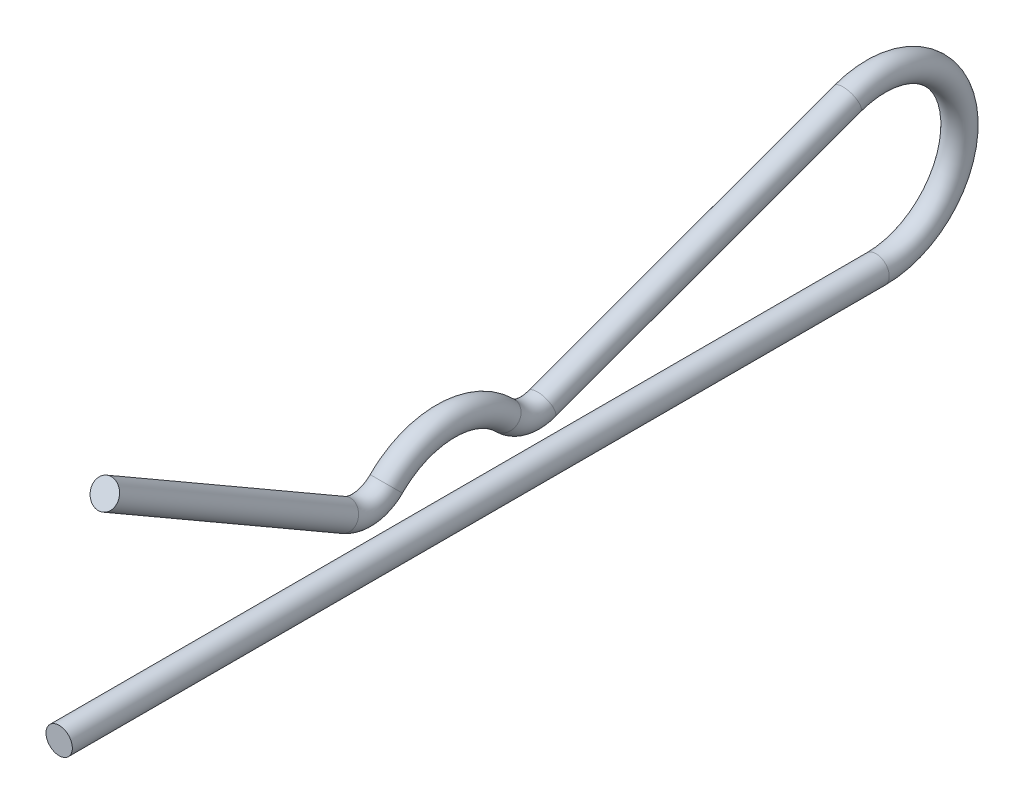
ISO-10303-21;
HEADER;
FILE_DESCRIPTION(('STEP AP214'),'2;1');
FILE_NAME('part.step','',(''),(''),'','','');
FILE_SCHEMA(('AUTOMOTIVE_DESIGN { 1 0 10303 214 1 1 1 1 }'));
ENDSEC;
DATA;
#1=APPLICATION_CONTEXT('core data for automotive mechanical design processes');
#2=APPLICATION_PROTOCOL_DEFINITION('international standard','automotive_design',2000,#1);
#3=PRODUCT_CONTEXT('',#1,'mechanical');
#4=PRODUCT('Part','Part','',(#3));
#5=PRODUCT_RELATED_PRODUCT_CATEGORY('part','',(#4));
#6=PRODUCT_DEFINITION_FORMATION('','',#4);
#7=PRODUCT_DEFINITION_CONTEXT('part definition',#1,'design');
#8=PRODUCT_DEFINITION('design','',#6,#7);
#9=PRODUCT_DEFINITION_SHAPE('','',#8);
#10=(LENGTH_UNIT() NAMED_UNIT(*) SI_UNIT(.MILLI.,.METRE.));
#11=(NAMED_UNIT(*) PLANE_ANGLE_UNIT() SI_UNIT($,.RADIAN.));
#12=(NAMED_UNIT(*) SI_UNIT($,.STERADIAN.) SOLID_ANGLE_UNIT());
#13=UNCERTAINTY_MEASURE_WITH_UNIT(LENGTH_MEASURE(1.E-05),#10,'distance_accuracy_value','');
#14=(GEOMETRIC_REPRESENTATION_CONTEXT(3) GLOBAL_UNCERTAINTY_ASSIGNED_CONTEXT((#13)) GLOBAL_UNIT_ASSIGNED_CONTEXT((#10,
#11,#12)) REPRESENTATION_CONTEXT('',''));
#15=CARTESIAN_POINT('',(0.,0.,0.));
#16=DIRECTION('',(0.,0.,1.));
#17=DIRECTION('',(1.,0.,0.));
#18=AXIS2_PLACEMENT_3D('',#15,#16,#17);
#19=CARTESIAN_POINT('',(0.,2.39549717149222,-12.8620587283705));
#20=DIRECTION('',(0.,0.499999999999991,0.866025403784443));
#21=DIRECTION('',(0.,-0.866025403784444,0.499999999999992));
#22=AXIS2_PLACEMENT_3D('',#19,#20,#21);
#23=CYLINDRICAL_SURFACE('',#22,0.5953125);
#24=CARTESIAN_POINT('',(0.,2.39549717149222,-12.8620587283705));
#25=DIRECTION('',(0.,-0.499999999999981,-0.86602540378445));
#26=DIRECTION('',(1.,0.,0.));
#27=AXIS2_PLACEMENT_3D('',#24,#25,#26);
#28=CIRCLE('',#27,0.5953125);
#29=CARTESIAN_POINT('',(0.,1.87994142330181,-12.5644024783705));
#30=VERTEX_POINT('',#29);
#31=EDGE_CURVE('E39',#30,#30,#28,.T.);
#32=ORIENTED_EDGE('',*,*,#31,.F.);
#33=EDGE_LOOP('',(#32));
#34=FACE_BOUND('',#33,.T.);
#35=CARTESIAN_POINT('',(0.,8.6299036226095,-2.06374999999995));
#36=DIRECTION('',(0.,-0.499999999999981,-0.86602540378445));
#37=DIRECTION('',(1.,0.,0.));
#38=AXIS2_PLACEMENT_3D('',#35,#36,#37);
#39=CIRCLE('',#38,0.5953125);
#40=CARTESIAN_POINT('',(0.5953125,8.6299036226095,-2.06374999999995));
#41=VERTEX_POINT('',#40);
#42=EDGE_CURVE('E10',#41,#41,#39,.T.);
#43=ORIENTED_EDGE('',*,*,#42,.T.);
#44=EDGE_LOOP('',(#43));
#45=FACE_BOUND('',#44,.T.);
#46=ADVANCED_FACE('F33',(#34,#45),#23,.T.);
#47=CARTESIAN_POINT('',(0.,3.7703125,-13.6558087283705));
#48=DIRECTION('',(-1.,0.,0.));
#49=DIRECTION('',(0.,0.,1.));
#50=AXIS2_PLACEMENT_3D('',#47,#48,#49);
#51=TOROIDAL_SURFACE('',#50,1.5875,0.5953125);
#52=CARTESIAN_POINT('',(0.,2.65318287037033,-14.7837172532977));
#53=DIRECTION('',(0.,0.710493559009301,-0.703703703703694));
#54=DIRECTION('',(1.,0.,0.));
#55=AXIS2_PLACEMENT_3D('',#52,#53,#54);
#56=CIRCLE('',#55,0.5953125);
#57=CARTESIAN_POINT('',(0.,2.2342592592592,-15.2066829501454));
#58=VERTEX_POINT('',#57);
#59=EDGE_CURVE('E43',#58,#58,#56,.T.);
#60=CARTESIAN_POINT('',(0.,3.7703125,-13.6558087283705));
#61=DIRECTION('',(-1.,0.,0.));
#62=DIRECTION('',(0.,0.,1.));
#63=AXIS2_PLACEMENT_3D('',#60,#61,#62);
#64=CIRCLE('',#63,2.1828125);
#65=EDGE_CURVE('',#58,#30,#64,.T.);
#66=ORIENTED_EDGE('',*,*,#59,.F.);
#67=ORIENTED_EDGE('',*,*,#31,.T.);
#68=ORIENTED_EDGE('',*,*,#65,.T.);
#69=ORIENTED_EDGE('',*,*,#65,.F.);
#70=EDGE_LOOP('',(#66,#68,#67,#69));
#71=FACE_BOUND('',#70,.T.);
#72=ADVANCED_FACE('F89',(#71),#51,.T.);
#73=CARTESIAN_POINT('',(0.,0.,-17.4625));
#74=DIRECTION('',(1.,0.,0.));
#75=DIRECTION('',(0.,0.,-1.));
#76=AXIS2_PLACEMENT_3D('',#73,#74,#75);
#77=TOROIDAL_SURFACE('',#76,3.7703125,0.5953125);
#78=CARTESIAN_POINT('',(0.,2.65318287037041,-20.1412827467022));
#79=DIRECTION('',(0.,-0.710493559009282,-0.703703703703714));
#80=DIRECTION('',(1.,0.,0.));
#81=AXIS2_PLACEMENT_3D('',#78,#79,#80);
#82=CIRCLE('',#81,0.5953125);
#83=CARTESIAN_POINT('',(0.,2.23425925925932,-19.7183170498544));
#84=VERTEX_POINT('',#83);
#85=EDGE_CURVE('E47',#84,#84,#82,.T.);
#86=ORIENTED_EDGE('',*,*,#85,.F.);
#87=EDGE_LOOP('',(#86));
#88=FACE_BOUND('',#87,.T.);
#89=ORIENTED_EDGE('',*,*,#59,.T.);
#90=EDGE_LOOP('',(#89));
#91=FACE_BOUND('',#90,.T.);
#92=ADVANCED_FACE('F83',(#88,#91),#77,.T.);
#93=CARTESIAN_POINT('',(0.,3.7703125,-21.2691912716295));
#94=DIRECTION('',(-1.,0.,0.));
#95=DIRECTION('',(0.,0.,1.));
#96=AXIS2_PLACEMENT_3D('',#93,#94,#95);
#97=TOROIDAL_SURFACE('',#96,1.5875,0.5953125);
#98=CARTESIAN_POINT('',(0.,2.27886678812647,-21.8130165547251));
#99=DIRECTION('',(0.,0.342567107461877,-0.939493361810078));
#100=DIRECTION('',(1.,0.,0.));
#101=AXIS2_PLACEMENT_3D('',#98,#99,#100);
#102=CIRCLE('',#101,0.5953125);
#103=CARTESIAN_POINT('',(0.,1.7195746461739,-22.016951035886));
#104=VERTEX_POINT('',#103);
#105=EDGE_CURVE('E52',#104,#104,#102,.T.);
#106=CARTESIAN_POINT('',(0.,3.7703125,-21.2691912716295));
#107=DIRECTION('',(-1.,0.,0.));
#108=DIRECTION('',(0.,0.,1.));
#109=AXIS2_PLACEMENT_3D('',#106,#107,#108);
#110=CIRCLE('',#109,2.1828125);
#111=EDGE_CURVE('',#104,#84,#110,.T.);
#112=ORIENTED_EDGE('',*,*,#105,.F.);
#113=ORIENTED_EDGE('',*,*,#85,.T.);
#114=ORIENTED_EDGE('',*,*,#111,.T.);
#115=ORIENTED_EDGE('',*,*,#111,.F.);
#116=EDGE_LOOP('',(#112,#114,#113,#115));
#117=FACE_BOUND('',#116,.T.);
#118=ADVANCED_FACE('F77',(#117),#97,.T.);
#119=CARTESIAN_POINT('',(0.,7.31249606569955,-35.6177899526476));
#120=DIRECTION('',(0.,-0.342567107461863,0.939493361810083));
#121=DIRECTION('',(0.,-0.939493361810083,-0.342567107461863));
#122=AXIS2_PLACEMENT_3D('',#119,#120,#121);
#123=CYLINDRICAL_SURFACE('',#122,0.5953125);
#124=CARTESIAN_POINT('',(0.,7.31249606569955,-35.6177899526476));
#125=DIRECTION('',(0.,0.342567107461877,-0.939493361810078));
#126=DIRECTION('',(1.,0.,0.));
#127=AXIS2_PLACEMENT_3D('',#124,#125,#126);
#128=CIRCLE('',#127,0.5953125);
#129=CARTESIAN_POINT('',(0.,7.87178820765212,-35.4138554714867));
#130=VERTEX_POINT('',#129);
#131=EDGE_CURVE('E55',#130,#130,#128,.T.);
#132=ORIENTED_EDGE('',*,*,#131,.F.);
#133=EDGE_LOOP('',(#132));
#134=FACE_BOUND('',#133,.T.);
#135=ORIENTED_EDGE('',*,*,#105,.T.);
#136=EDGE_LOOP('',(#135));
#137=FACE_BOUND('',#136,.T.);
#138=ADVANCED_FACE('F71',(#134,#137),#123,.T.);
#139=CARTESIAN_POINT('',(0.,3.7703125,-36.909375));
#140=DIRECTION('',(1.,0.,0.));
#141=DIRECTION('',(0.,0.,-1.));
#142=AXIS2_PLACEMENT_3D('',#139,#140,#141);
#143=TOROIDAL_SURFACE('',#142,3.77031249999999,0.5953125);
#144=CARTESIAN_POINT('',(0.,0.,-36.909375));
#145=DIRECTION('',(0.,0.,1.));
#146=DIRECTION('',(1.,0.,0.));
#147=AXIS2_PLACEMENT_3D('',#144,#145,#146);
#148=CIRCLE('',#147,0.5953125);
#149=CARTESIAN_POINT('',(0.,-0.595312499999994,-36.909375));
#150=VERTEX_POINT('',#149);
#151=EDGE_CURVE('E58',#150,#150,#148,.T.);
#152=CARTESIAN_POINT('',(0.,3.7703125,-36.909375));
#153=DIRECTION('',(1.,0.,0.));
#154=DIRECTION('',(0.,0.,-1.));
#155=AXIS2_PLACEMENT_3D('',#152,#153,#154);
#156=CIRCLE('',#155,4.36562499999999);
#157=EDGE_CURVE('',#150,#130,#156,.T.);
#158=ORIENTED_EDGE('',*,*,#151,.F.);
#159=ORIENTED_EDGE('',*,*,#131,.T.);
#160=ORIENTED_EDGE('',*,*,#157,.T.);
#161=ORIENTED_EDGE('',*,*,#157,.F.);
#162=EDGE_LOOP('',(#158,#160,#159,#161));
#163=FACE_BOUND('',#162,.T.);
#164=ADVANCED_FACE('F68',(#163),#143,.T.);
#165=CARTESIAN_POINT('',(0.,0.,-36.909375));
#166=DIRECTION('',(0.,0.,1.));
#167=DIRECTION('',(0.,-1.,0.));
#168=AXIS2_PLACEMENT_3D('',#165,#166,#167);
#169=CYLINDRICAL_SURFACE('',#168,0.5953125);
#170=ORIENTED_EDGE('',*,*,#151,.T.);
#171=EDGE_LOOP('',(#170));
#172=FACE_BOUND('',#171,.T.);
#173=CARTESIAN_POINT('',(0.,0.,0.));
#174=DIRECTION('',(0.,0.,1.));
#175=DIRECTION('',(1.,0.,0.));
#176=AXIS2_PLACEMENT_3D('',#173,#174,#175);
#177=CIRCLE('',#176,0.5953125);
#178=CARTESIAN_POINT('',(0.5953125,0.,0.));
#179=VERTEX_POINT('',#178);
#180=EDGE_CURVE('E59',#179,#179,#177,.T.);
#181=ORIENTED_EDGE('',*,*,#180,.F.);
#182=EDGE_LOOP('',(#181));
#183=FACE_BOUND('',#182,.T.);
#184=ADVANCED_FACE('F65',(#172,#183),#169,.T.);
#185=CARTESIAN_POINT('',(0.,8.6299036226095,-2.06374999999995));
#186=DIRECTION('',(0.,-0.499999999999981,-0.86602540378445));
#187=DIRECTION('',(1.,0.,0.));
#188=AXIS2_PLACEMENT_3D('',#185,#186,#187);
#189=PLANE('',#188);
#190=ORIENTED_EDGE('',*,*,#42,.F.);
#191=EDGE_LOOP('',(#190));
#192=FACE_BOUND('',#191,.T.);
#193=ADVANCED_FACE('F101',(#192),#189,.F.);
#194=CARTESIAN_POINT('',(0.,0.,0.));
#195=DIRECTION('',(0.,0.,1.));
#196=DIRECTION('',(1.,0.,0.));
#197=AXIS2_PLACEMENT_3D('',#194,#195,#196);
#198=PLANE('',#197);
#199=ORIENTED_EDGE('',*,*,#180,.T.);
#200=EDGE_LOOP('',(#199));
#201=FACE_BOUND('',#200,.T.);
#202=ADVANCED_FACE('F102',(#201),#198,.T.);
#203=CLOSED_SHELL('',(#46,#72,#92,#118,#138,#164,#184,#193,#202));
#204=MANIFOLD_SOLID_BREP('B2',#203);
#205=ADVANCED_BREP_SHAPE_REPRESENTATION('',(#18,#204),#14);
#206=SHAPE_DEFINITION_REPRESENTATION(#9,#205);
ENDSEC;
END-ISO-10303-21;
